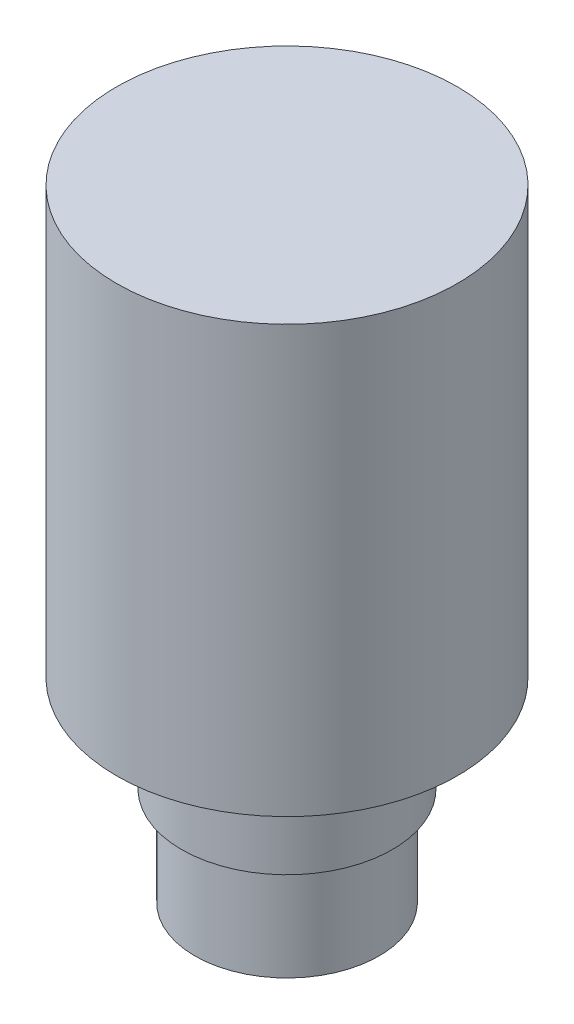
ISO-10303-21;
HEADER;
FILE_DESCRIPTION(('STEP AP214'),'2;1');
FILE_NAME('part.step','',(''),(''),'','','');
FILE_SCHEMA(('AUTOMOTIVE_DESIGN { 1 0 10303 214 1 1 1 1 }'));
ENDSEC;
DATA;
#1=APPLICATION_CONTEXT('core data for automotive mechanical design processes');
#2=APPLICATION_PROTOCOL_DEFINITION('international standard','automotive_design',2000,#1);
#3=PRODUCT_CONTEXT('',#1,'mechanical');
#4=PRODUCT('Part','Part','',(#3));
#5=PRODUCT_RELATED_PRODUCT_CATEGORY('part','',(#4));
#6=PRODUCT_DEFINITION_FORMATION('','',#4);
#7=PRODUCT_DEFINITION_CONTEXT('part definition',#1,'design');
#8=PRODUCT_DEFINITION('design','',#6,#7);
#9=PRODUCT_DEFINITION_SHAPE('','',#8);
#10=(LENGTH_UNIT() NAMED_UNIT(*) SI_UNIT(.MILLI.,.METRE.));
#11=(NAMED_UNIT(*) PLANE_ANGLE_UNIT() SI_UNIT($,.RADIAN.));
#12=(NAMED_UNIT(*) SI_UNIT($,.STERADIAN.) SOLID_ANGLE_UNIT());
#13=UNCERTAINTY_MEASURE_WITH_UNIT(LENGTH_MEASURE(1.E-05),#10,'distance_accuracy_value','');
#14=(GEOMETRIC_REPRESENTATION_CONTEXT(3) GLOBAL_UNCERTAINTY_ASSIGNED_CONTEXT((#13)) GLOBAL_UNIT_ASSIGNED_CONTEXT((#10,
#11,#12)) REPRESENTATION_CONTEXT('',''));
#15=CARTESIAN_POINT('',(0.,0.,0.));
#16=DIRECTION('',(0.,0.,1.));
#17=DIRECTION('',(1.,0.,0.));
#18=AXIS2_PLACEMENT_3D('',#15,#16,#17);
#19=CARTESIAN_POINT('',(0.,0.,-19.431));
#20=DIRECTION('',(0.,-1.,0.));
#21=DIRECTION('',(0.,0.,-1.));
#22=AXIS2_PLACEMENT_3D('',#19,#20,#21);
#23=PLANE('',#22);
#24=CARTESIAN_POINT('',(0.,0.,0.));
#25=DIRECTION('',(0.,-1.,0.));
#26=DIRECTION('',(0.,0.,-1.));
#27=AXIS2_PLACEMENT_3D('',#24,#25,#26);
#28=CIRCLE('',#27,19.431);
#29=CARTESIAN_POINT('',(0.,0.,-19.431));
#30=VERTEX_POINT('',#29);
#31=EDGE_CURVE('E62',#30,#30,#28,.T.);
#32=ORIENTED_EDGE('',*,*,#31,.T.);
#33=EDGE_LOOP('',(#32));
#34=FACE_BOUND('',#33,.T.);
#35=ADVANCED_FACE('F34',(#34),#23,.T.);
#36=CARTESIAN_POINT('',(0.,131.064,0.));
#37=DIRECTION('',(0.,1.,0.));
#38=DIRECTION('',(0.,0.,1.));
#39=AXIS2_PLACEMENT_3D('',#36,#37,#38);
#40=PLANE('',#39);
#41=CARTESIAN_POINT('',(0.,131.064,0.));
#42=DIRECTION('',(0.,-1.,0.));
#43=DIRECTION('',(0.,0.,-1.));
#44=AXIS2_PLACEMENT_3D('',#41,#42,#43);
#45=CIRCLE('',#44,35.941);
#46=CARTESIAN_POINT('',(0.,131.064,-35.941));
#47=VERTEX_POINT('',#46);
#48=EDGE_CURVE('E10',#47,#47,#45,.T.);
#49=ORIENTED_EDGE('',*,*,#48,.F.);
#50=EDGE_LOOP('',(#49));
#51=FACE_BOUND('',#50,.T.);
#52=ADVANCED_FACE('F79',(#51),#40,.T.);
#53=CARTESIAN_POINT('',(0.,0.,0.));
#54=DIRECTION('',(0.,-1.,0.));
#55=DIRECTION('',(0.,0.,-1.));
#56=AXIS2_PLACEMENT_3D('',#53,#54,#55);
#57=CYLINDRICAL_SURFACE('',#56,35.941);
#58=ORIENTED_EDGE('',*,*,#48,.T.);
#59=EDGE_LOOP('',(#58));
#60=FACE_BOUND('',#59,.T.);
#61=CARTESIAN_POINT('',(0.,41.148,0.));
#62=DIRECTION('',(0.,-1.,0.));
#63=DIRECTION('',(0.,0.,-1.));
#64=AXIS2_PLACEMENT_3D('',#61,#62,#63);
#65=CIRCLE('',#64,35.941);
#66=CARTESIAN_POINT('',(0.,41.148,-35.941));
#67=VERTEX_POINT('',#66);
#68=EDGE_CURVE('E40',#67,#67,#65,.T.);
#69=ORIENTED_EDGE('',*,*,#68,.F.);
#70=EDGE_LOOP('',(#69));
#71=FACE_BOUND('',#70,.T.);
#72=ADVANCED_FACE('F83',(#60,#71),#57,.T.);
#73=CARTESIAN_POINT('',(0.,41.148,-35.941));
#74=DIRECTION('',(0.,-1.,0.));
#75=DIRECTION('',(0.,0.,-1.));
#76=AXIS2_PLACEMENT_3D('',#73,#74,#75);
#77=PLANE('',#76);
#78=ORIENTED_EDGE('',*,*,#68,.T.);
#79=EDGE_LOOP('',(#78));
#80=FACE_BOUND('',#79,.T.);
#81=CARTESIAN_POINT('',(0.,41.148,0.));
#82=DIRECTION('',(0.,-1.,0.));
#83=DIRECTION('',(0.,0.,-1.));
#84=AXIS2_PLACEMENT_3D('',#81,#82,#83);
#85=CIRCLE('',#84,19.431);
#86=CARTESIAN_POINT('',(0.,41.148,-19.431));
#87=VERTEX_POINT('',#86);
#88=EDGE_CURVE('E44',#87,#87,#85,.T.);
#89=ORIENTED_EDGE('',*,*,#88,.F.);
#90=EDGE_LOOP('',(#89));
#91=FACE_BOUND('',#90,.T.);
#92=ADVANCED_FACE('F88',(#80,#91),#77,.T.);
#93=CARTESIAN_POINT('',(0.,0.,0.));
#94=DIRECTION('',(0.,-1.,0.));
#95=DIRECTION('',(0.,0.,-1.));
#96=AXIS2_PLACEMENT_3D('',#93,#94,#95);
#97=CYLINDRICAL_SURFACE('',#96,19.431);
#98=ORIENTED_EDGE('',*,*,#88,.T.);
#99=EDGE_LOOP('',(#98));
#100=FACE_BOUND('',#99,.T.);
#101=CARTESIAN_POINT('',(0.,34.798,0.));
#102=DIRECTION('',(0.,-1.,0.));
#103=DIRECTION('',(0.,0.,-1.));
#104=AXIS2_PLACEMENT_3D('',#101,#102,#103);
#105=CIRCLE('',#104,19.431);
#106=CARTESIAN_POINT('',(0.,34.798,-19.431));
#107=VERTEX_POINT('',#106);
#108=EDGE_CURVE('E48',#107,#107,#105,.T.);
#109=ORIENTED_EDGE('',*,*,#108,.F.);
#110=EDGE_LOOP('',(#109));
#111=FACE_BOUND('',#110,.T.);
#112=ADVANCED_FACE('F93',(#100,#111),#97,.T.);
#113=CARTESIAN_POINT('',(0.,34.798,-19.431));
#114=DIRECTION('',(0.,1.,0.));
#115=DIRECTION('',(0.,0.,1.));
#116=AXIS2_PLACEMENT_3D('',#113,#114,#115);
#117=PLANE('',#116);
#118=ORIENTED_EDGE('',*,*,#108,.T.);
#119=EDGE_LOOP('',(#118));
#120=FACE_BOUND('',#119,.T.);
#121=CARTESIAN_POINT('',(0.,34.798,0.));
#122=DIRECTION('',(0.,-1.,0.));
#123=DIRECTION('',(0.,0.,-1.));
#124=AXIS2_PLACEMENT_3D('',#121,#122,#123);
#125=CIRCLE('',#124,22.225);
#126=CARTESIAN_POINT('',(0.,34.798,-22.225));
#127=VERTEX_POINT('',#126);
#128=EDGE_CURVE('E53',#127,#127,#125,.T.);
#129=ORIENTED_EDGE('',*,*,#128,.F.);
#130=EDGE_LOOP('',(#129));
#131=FACE_BOUND('',#130,.T.);
#132=ADVANCED_FACE('F96',(#120,#131),#117,.T.);
#133=CARTESIAN_POINT('',(0.,0.,0.));
#134=DIRECTION('',(0.,-1.,0.));
#135=DIRECTION('',(0.,0.,-1.));
#136=AXIS2_PLACEMENT_3D('',#133,#134,#135);
#137=CYLINDRICAL_SURFACE('',#136,22.225);
#138=ORIENTED_EDGE('',*,*,#128,.T.);
#139=EDGE_LOOP('',(#138));
#140=FACE_BOUND('',#139,.T.);
#141=CARTESIAN_POINT('',(0.,20.828,0.));
#142=DIRECTION('',(0.,-1.,0.));
#143=DIRECTION('',(0.,0.,-1.));
#144=AXIS2_PLACEMENT_3D('',#141,#142,#143);
#145=CIRCLE('',#144,22.225);
#146=CARTESIAN_POINT('',(0.,20.828,-22.225));
#147=VERTEX_POINT('',#146);
#148=EDGE_CURVE('E56',#147,#147,#145,.T.);
#149=ORIENTED_EDGE('',*,*,#148,.F.);
#150=EDGE_LOOP('',(#149));
#151=FACE_BOUND('',#150,.T.);
#152=ADVANCED_FACE('F75',(#140,#151),#137,.T.);
#153=CARTESIAN_POINT('',(0.,20.828,-22.225));
#154=DIRECTION('',(0.,-1.,0.));
#155=DIRECTION('',(0.,0.,-1.));
#156=AXIS2_PLACEMENT_3D('',#153,#154,#155);
#157=PLANE('',#156);
#158=ORIENTED_EDGE('',*,*,#148,.T.);
#159=EDGE_LOOP('',(#158));
#160=FACE_BOUND('',#159,.T.);
#161=CARTESIAN_POINT('',(0.,20.828,0.));
#162=DIRECTION('',(0.,-1.,0.));
#163=DIRECTION('',(0.,0.,-1.));
#164=AXIS2_PLACEMENT_3D('',#161,#162,#163);
#165=CIRCLE('',#164,19.431);
#166=CARTESIAN_POINT('',(0.,20.828,-19.431));
#167=VERTEX_POINT('',#166);
#168=EDGE_CURVE('E59',#167,#167,#165,.T.);
#169=ORIENTED_EDGE('',*,*,#168,.F.);
#170=EDGE_LOOP('',(#169));
#171=FACE_BOUND('',#170,.T.);
#172=ADVANCED_FACE('F69',(#160,#171),#157,.T.);
#173=CARTESIAN_POINT('',(0.,0.,0.));
#174=DIRECTION('',(0.,-1.,0.));
#175=DIRECTION('',(0.,0.,-1.));
#176=AXIS2_PLACEMENT_3D('',#173,#174,#175);
#177=CYLINDRICAL_SURFACE('',#176,19.431);
#178=ORIENTED_EDGE('',*,*,#168,.T.);
#179=EDGE_LOOP('',(#178));
#180=FACE_BOUND('',#179,.T.);
#181=ORIENTED_EDGE('',*,*,#31,.F.);
#182=EDGE_LOOP('',(#181));
#183=FACE_BOUND('',#182,.T.);
#184=ADVANCED_FACE('F67',(#180,#183),#177,.T.);
#185=CLOSED_SHELL('',(#35,#52,#72,#92,#112,#132,#152,#172,#184));
#186=MANIFOLD_SOLID_BREP('B2',#185);
#187=ADVANCED_BREP_SHAPE_REPRESENTATION('',(#18,#186),#14);
#188=SHAPE_DEFINITION_REPRESENTATION(#9,#187);
ENDSEC;
END-ISO-10303-21;
